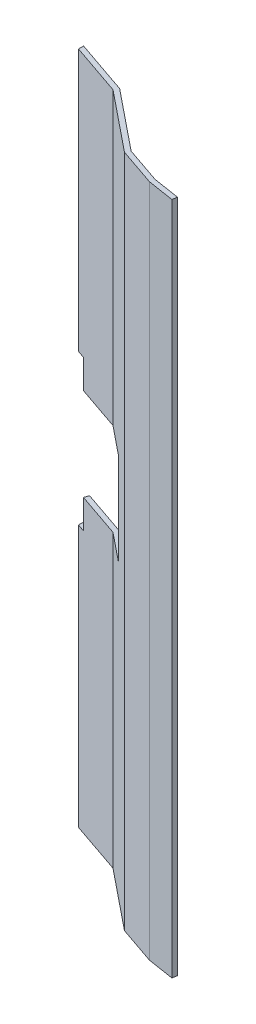
ISO-10303-21;
HEADER;
FILE_DESCRIPTION(('STEP AP214'),'2;1');
FILE_NAME('part.step','',(''),(''),'','','');
FILE_SCHEMA(('AUTOMOTIVE_DESIGN { 1 0 10303 214 1 1 1 1 }'));
ENDSEC;
DATA;
#1=APPLICATION_CONTEXT('core data for automotive mechanical design processes');
#2=APPLICATION_PROTOCOL_DEFINITION('international standard','automotive_design',2000,#1);
#3=PRODUCT_CONTEXT('',#1,'mechanical');
#4=PRODUCT('Part','Part','',(#3));
#5=PRODUCT_RELATED_PRODUCT_CATEGORY('part','',(#4));
#6=PRODUCT_DEFINITION_FORMATION('','',#4);
#7=PRODUCT_DEFINITION_CONTEXT('part definition',#1,'design');
#8=PRODUCT_DEFINITION('design','',#6,#7);
#9=PRODUCT_DEFINITION_SHAPE('','',#8);
#10=(LENGTH_UNIT() NAMED_UNIT(*) SI_UNIT(.MILLI.,.METRE.));
#11=(NAMED_UNIT(*) PLANE_ANGLE_UNIT() SI_UNIT($,.RADIAN.));
#12=(NAMED_UNIT(*) SI_UNIT($,.STERADIAN.) SOLID_ANGLE_UNIT());
#13=UNCERTAINTY_MEASURE_WITH_UNIT(LENGTH_MEASURE(1.E-05),#10,'distance_accuracy_value','');
#14=(GEOMETRIC_REPRESENTATION_CONTEXT(3) GLOBAL_UNCERTAINTY_ASSIGNED_CONTEXT((#13)) GLOBAL_UNIT_ASSIGNED_CONTEXT((#10,
#11,#12)) REPRESENTATION_CONTEXT('',''));
#15=CARTESIAN_POINT('',(0.,0.,0.));
#16=DIRECTION('',(0.,0.,1.));
#17=DIRECTION('',(1.,0.,0.));
#18=AXIS2_PLACEMENT_3D('',#15,#16,#17);
#19=CARTESIAN_POINT('',(-37.0625663664755,222.25,-23.5831818109705));
#20=DIRECTION('',(1.,0.,0.));
#21=DIRECTION('',(0.,0.,-1.));
#22=AXIS2_PLACEMENT_3D('',#19,#20,#21);
#23=PLANE('',#22);
#24=DIRECTION('',(0.,0.,1.));
#25=VECTOR('',#24,1.);
#26=CARTESIAN_POINT('',(-37.0625663664755,86.36,-23.5831818109705));
#27=LINE('',#26,#25);
#28=CARTESIAN_POINT('',(-37.0625663664755,86.36,-23.5831818109705));
#29=VERTEX_POINT('',#28);
#30=CARTESIAN_POINT('',(-37.0625663664755,86.36,-21.904788085952));
#31=VERTEX_POINT('',#30);
#32=EDGE_CURVE('E230',#29,#31,#27,.T.);
#33=ORIENTED_EDGE('',*,*,#32,.F.);
#34=DIRECTION('',(0.,-1.,0.));
#35=VECTOR('',#34,1.);
#36=CARTESIAN_POINT('',(-37.0625663664755,222.25,-23.5831818109705));
#37=LINE('',#36,#35);
#38=CARTESIAN_POINT('',(-37.0625663664755,0.,-23.5831818109705));
#39=VERTEX_POINT('',#38);
#40=EDGE_CURVE('E100',#29,#39,#37,.T.);
#41=ORIENTED_EDGE('',*,*,#40,.T.);
#42=DIRECTION('',(0.,0.,1.));
#43=VECTOR('',#42,1.);
#44=CARTESIAN_POINT('',(-37.0625663664755,0.,-23.5831818109705));
#45=LINE('',#44,#43);
#46=CARTESIAN_POINT('',(-37.0625663664755,0.,-21.904788085952));
#47=VERTEX_POINT('',#46);
#48=EDGE_CURVE('E161',#39,#47,#45,.T.);
#49=ORIENTED_EDGE('',*,*,#48,.T.);
#50=DIRECTION('',(0.,-1.,0.));
#51=VECTOR('',#50,1.);
#52=CARTESIAN_POINT('',(-37.0625663664755,222.25,-21.904788085952));
#53=LINE('',#52,#51);
#54=EDGE_CURVE('E205',#31,#47,#53,.T.);
#55=ORIENTED_EDGE('',*,*,#54,.F.);
#56=EDGE_LOOP('',(#33,#41,#49,#55));
#57=FACE_BOUND('',#56,.T.);
#58=ADVANCED_FACE('F36',(#57),#23,.F.);
#59=CARTESIAN_POINT('',(-37.0625663664755,222.25,-21.904788085952));
#60=DIRECTION('',(0.32461914387771,0.,-0.945844813607445));
#61=DIRECTION('',(-0.945844813607445,0.,-0.32461914387771));
#62=AXIS2_PLACEMENT_3D('',#59,#60,#61);
#63=PLANE('',#62);
#64=DIRECTION('',(0.945844813607445,0.,0.32461914387771));
#65=VECTOR('',#64,1.);
#66=CARTESIAN_POINT('',(-37.0625663664755,86.36,-21.904788085952));
#67=LINE('',#66,#65);
#68=CARTESIAN_POINT('',(-34.5748419741777,86.36,-21.0509873875569));
#69=VERTEX_POINT('',#68);
#70=EDGE_CURVE('E238',#31,#69,#67,.T.);
#71=ORIENTED_EDGE('',*,*,#70,.F.);
#72=ORIENTED_EDGE('',*,*,#54,.T.);
#73=DIRECTION('',(0.945844813607445,0.,0.32461914387771));
#74=VECTOR('',#73,1.);
#75=CARTESIAN_POINT('',(-37.0625663664755,0.,-21.904788085952));
#76=LINE('',#75,#74);
#77=CARTESIAN_POINT('',(-19.7555384832619,0.,-15.964920896652));
#78=VERTEX_POINT('',#77);
#79=EDGE_CURVE('E163',#47,#78,#76,.T.);
#80=ORIENTED_EDGE('',*,*,#79,.T.);
#81=DIRECTION('',(0.,-1.,0.));
#82=VECTOR('',#81,1.);
#83=CARTESIAN_POINT('',(-19.7555384832619,222.25,-15.964920896652));
#84=LINE('',#83,#82);
#85=CARTESIAN_POINT('',(-19.7555384832619,95.885,-15.964920896652));
#86=VERTEX_POINT('',#85);
#87=EDGE_CURVE('E201',#86,#78,#84,.T.);
#88=ORIENTED_EDGE('',*,*,#87,.F.);
#89=DIRECTION('',(0.945844813607445,0.,0.32461914387771));
#90=VECTOR('',#89,1.);
#91=CARTESIAN_POINT('',(-37.0625663664755,95.885,-21.904788085952));
#92=LINE('',#91,#90);
#93=CARTESIAN_POINT('',(-34.5748419741777,95.885,-21.0509873875569));
#94=VERTEX_POINT('',#93);
#95=EDGE_CURVE('E483',#94,#86,#92,.T.);
#96=ORIENTED_EDGE('',*,*,#95,.F.);
#97=DIRECTION('',(0.,-1.,0.));
#98=VECTOR('',#97,1.);
#99=CARTESIAN_POINT('',(-34.5748419741777,222.25,-21.0509873875569));
#100=LINE('',#99,#98);
#101=EDGE_CURVE('E239',#94,#69,#100,.T.);
#102=ORIENTED_EDGE('',*,*,#101,.T.);
#103=EDGE_LOOP('',(#71,#72,#80,#88,#96,#102));
#104=FACE_BOUND('',#103,.T.);
#105=ADVANCED_FACE('F253',(#104),#63,.F.);
#106=CARTESIAN_POINT('',(-19.7555384832619,222.25,-15.964920896652));
#107=DIRECTION('',(0.628540192781588,0.,-0.777777105640224));
#108=DIRECTION('',(-0.777777105640224,0.,-0.628540192781588));
#109=AXIS2_PLACEMENT_3D('',#106,#107,#108);
#110=PLANE('',#109);
#111=DIRECTION('',(0.777777105640224,0.,0.628540192781588));
#112=VECTOR('',#111,1.);
#113=CARTESIAN_POINT('',(-19.7555384832619,95.885,-15.964920896652));
#114=LINE('',#113,#112);
#115=CARTESIAN_POINT('',(-10.1235048545214,95.885,-8.18104524643741));
#116=VERTEX_POINT('',#115);
#117=EDGE_CURVE('E479',#86,#116,#114,.T.);
#118=ORIENTED_EDGE('',*,*,#117,.F.);
#119=ORIENTED_EDGE('',*,*,#87,.T.);
#120=DIRECTION('',(0.777777105640224,0.,0.628540192781588));
#121=VECTOR('',#120,1.);
#122=CARTESIAN_POINT('',(-19.7555384832619,0.,-15.964920896652));
#123=LINE('',#122,#121);
#124=CARTESIAN_POINT('',(-1.85654047094307E-13,0.,3.86479261003734E-13));
#125=VERTEX_POINT('',#124);
#126=EDGE_CURVE('E167',#78,#125,#123,.T.);
#127=ORIENTED_EDGE('',*,*,#126,.T.);
#128=DIRECTION('',(0.,-1.,0.));
#129=VECTOR('',#128,1.);
#130=CARTESIAN_POINT('',(-1.85654047094307E-13,222.25,3.86479261003734E-13));
#131=LINE('',#130,#129);
#132=CARTESIAN_POINT('',(-1.85654047094307E-13,222.25,3.86479261003734E-13));
#133=VERTEX_POINT('',#132);
#134=EDGE_CURVE('E198',#133,#125,#131,.T.);
#135=ORIENTED_EDGE('',*,*,#134,.F.);
#136=DIRECTION('',(0.777777105640224,0.,0.628540192781588));
#137=VECTOR('',#136,1.);
#138=CARTESIAN_POINT('',(-19.7555384832619,222.25,-15.964920896652));
#139=LINE('',#138,#137);
#140=CARTESIAN_POINT('',(-19.7555384832619,222.25,-15.964920896652));
#141=VERTEX_POINT('',#140);
#142=EDGE_CURVE('E277',#141,#133,#139,.T.);
#143=ORIENTED_EDGE('',*,*,#142,.F.);
#144=CARTESIAN_POINT('',(-19.7555384832619,126.365,-15.964920896652));
#145=VERTEX_POINT('',#144);
#146=EDGE_CURVE('E202',#141,#145,#84,.T.);
#147=ORIENTED_EDGE('',*,*,#146,.T.);
#148=DIRECTION('',(0.777777105640224,0.,0.628540192781588));
#149=VECTOR('',#148,1.);
#150=CARTESIAN_POINT('',(-19.7555384832619,126.365,-15.964920896652));
#151=LINE('',#150,#149);
#152=CARTESIAN_POINT('',(-10.1235048545214,126.365,-8.18104524643741));
#153=VERTEX_POINT('',#152);
#154=EDGE_CURVE('E491',#145,#153,#151,.T.);
#155=ORIENTED_EDGE('',*,*,#154,.T.);
#156=DIRECTION('',(0.,-1.,0.));
#157=VECTOR('',#156,1.);
#158=CARTESIAN_POINT('',(-10.1235048545214,222.25,-8.18104524643739));
#159=LINE('',#158,#157);
#160=EDGE_CURVE('E164',#153,#116,#159,.T.);
#161=ORIENTED_EDGE('',*,*,#160,.T.);
#162=EDGE_LOOP('',(#118,#119,#127,#135,#143,#147,#155,#161));
#163=FACE_BOUND('',#162,.T.);
#164=ADVANCED_FACE('F338',(#163),#110,.F.);
#165=CARTESIAN_POINT('',(0.780092902725611,222.25,-1.41066154888906));
#166=DIRECTION('',(-0.628540192781588,0.,0.777777105640224));
#167=DIRECTION('',(0.777777105640224,0.,0.628540192781588));
#168=AXIS2_PLACEMENT_3D('',#165,#166,#167);
#169=PLANE('',#168);
#170=DIRECTION('',(-0.777777105640224,0.,-0.628540192781588));
#171=VECTOR('',#170,1.);
#172=CARTESIAN_POINT('',(0.780092902725611,95.885,-1.41066154888906));
#173=LINE('',#172,#171);
#174=CARTESIAN_POINT('',(-9.5750990465936,95.885,-9.77893865156602));
#175=VERTEX_POINT('',#174);
#176=CARTESIAN_POINT('',(-18.9754455805351,95.885,-17.3755824455406));
#177=VERTEX_POINT('',#176);
#178=EDGE_CURVE('E297',#175,#177,#173,.T.);
#179=ORIENTED_EDGE('',*,*,#178,.F.);
#180=DIRECTION('',(0.,1.,0.));
#181=VECTOR('',#180,1.);
#182=CARTESIAN_POINT('',(-9.57509904659358,222.25,-9.77893865156601));
#183=LINE('',#182,#181);
#184=CARTESIAN_POINT('',(-9.5750990465936,126.365,-9.77893865156603));
#185=VERTEX_POINT('',#184);
#186=EDGE_CURVE('E11',#175,#185,#183,.T.);
#187=ORIENTED_EDGE('',*,*,#186,.T.);
#188=DIRECTION('',(-0.777777105640224,0.,-0.628540192781588));
#189=VECTOR('',#188,1.);
#190=CARTESIAN_POINT('',(0.780092902725611,126.365,-1.41066154888906));
#191=LINE('',#190,#189);
#192=CARTESIAN_POINT('',(-18.9754455805351,126.365,-17.3755824455406));
#193=VERTEX_POINT('',#192);
#194=EDGE_CURVE('E493',#185,#193,#191,.T.);
#195=ORIENTED_EDGE('',*,*,#194,.T.);
#196=DIRECTION('',(0.,-1.,0.));
#197=VECTOR('',#196,1.);
#198=CARTESIAN_POINT('',(-18.9754455805351,222.25,-17.3755824455406));
#199=LINE('',#198,#197);
#200=CARTESIAN_POINT('',(-18.9754455805351,222.25,-17.3755824455406));
#201=VERTEX_POINT('',#200);
#202=EDGE_CURVE('E151',#201,#193,#199,.T.);
#203=ORIENTED_EDGE('',*,*,#202,.F.);
#204=DIRECTION('',(-0.777777105640224,0.,-0.628540192781588));
#205=VECTOR('',#204,1.);
#206=CARTESIAN_POINT('',(0.780092902725611,222.25,-1.41066154888906));
#207=LINE('',#206,#205);
#208=CARTESIAN_POINT('',(0.780092902725611,222.25,-1.41066154888906));
#209=VERTEX_POINT('',#208);
#210=EDGE_CURVE('E134',#209,#201,#207,.T.);
#211=ORIENTED_EDGE('',*,*,#210,.F.);
#212=DIRECTION('',(0.,-1.,0.));
#213=VECTOR('',#212,1.);
#214=CARTESIAN_POINT('',(0.780092902725611,222.25,-1.41066154888906));
#215=LINE('',#214,#213);
#216=CARTESIAN_POINT('',(0.780092902725611,0.,-1.41066154888906));
#217=VERTEX_POINT('',#216);
#218=EDGE_CURVE('E143',#209,#217,#215,.T.);
#219=ORIENTED_EDGE('',*,*,#218,.T.);
#220=DIRECTION('',(-0.777777105640224,0.,-0.628540192781588));
#221=VECTOR('',#220,1.);
#222=CARTESIAN_POINT('',(0.780092902725611,0.,-1.41066154888906));
#223=LINE('',#222,#221);
#224=CARTESIAN_POINT('',(-18.9754455805351,0.,-17.3755824455406));
#225=VERTEX_POINT('',#224);
#226=EDGE_CURVE('E178',#217,#225,#223,.T.);
#227=ORIENTED_EDGE('',*,*,#226,.T.);
#228=EDGE_CURVE('E186',#177,#225,#199,.T.);
#229=ORIENTED_EDGE('',*,*,#228,.F.);
#230=EDGE_LOOP('',(#179,#187,#195,#203,#211,#219,#227,#229));
#231=FACE_BOUND('',#230,.T.);
#232=ADVANCED_FACE('F154',(#231),#169,.F.);
#233=CARTESIAN_POINT('',(-18.9754455805351,222.25,-17.3755824455406));
#234=DIRECTION('',(-0.32461914387771,0.,0.945844813607445));
#235=DIRECTION('',(0.945844813607445,0.,0.32461914387771));
#236=AXIS2_PLACEMENT_3D('',#233,#234,#235);
#237=PLANE('',#236);
#238=DIRECTION('',(-0.945844813607445,0.,-0.32461914387771));
#239=VECTOR('',#238,1.);
#240=CARTESIAN_POINT('',(-18.9754455805351,86.36,-17.3755824455406));
#241=LINE('',#240,#239);
#242=CARTESIAN_POINT('',(-34.0595090832718,86.36,-22.5525160291587));
#243=VERTEX_POINT('',#242);
#244=EDGE_CURVE('E44',#243,#29,#241,.T.);
#245=ORIENTED_EDGE('',*,*,#244,.F.);
#246=DIRECTION('',(0.,1.,0.));
#247=VECTOR('',#246,1.);
#248=CARTESIAN_POINT('',(-34.0595090832718,222.25,-22.5525160291587));
#249=LINE('',#248,#247);
#250=CARTESIAN_POINT('',(-34.0595090832718,95.885,-22.5525160291588));
#251=VERTEX_POINT('',#250);
#252=EDGE_CURVE('E219',#243,#251,#249,.T.);
#253=ORIENTED_EDGE('',*,*,#252,.T.);
#254=DIRECTION('',(-0.945844813607445,0.,-0.32461914387771));
#255=VECTOR('',#254,1.);
#256=CARTESIAN_POINT('',(-18.9754455805351,95.885,-17.3755824455406));
#257=LINE('',#256,#255);
#258=EDGE_CURVE('E216',#177,#251,#257,.T.);
#259=ORIENTED_EDGE('',*,*,#258,.F.);
#260=ORIENTED_EDGE('',*,*,#228,.T.);
#261=DIRECTION('',(-0.945844813607445,0.,-0.32461914387771));
#262=VECTOR('',#261,1.);
#263=CARTESIAN_POINT('',(-18.9754455805351,0.,-17.3755824455406));
#264=LINE('',#263,#262);
#265=EDGE_CURVE('E180',#225,#39,#264,.T.);
#266=ORIENTED_EDGE('',*,*,#265,.T.);
#267=ORIENTED_EDGE('',*,*,#40,.F.);
#268=EDGE_LOOP('',(#245,#253,#259,#260,#266,#267));
#269=FACE_BOUND('',#268,.T.);
#270=ADVANCED_FACE('F241',(#269),#237,.F.);
#271=CARTESIAN_POINT('',(-37.0625663664755,222.25,-23.5831818109705));
#272=VERTEX_POINT('',#271);
#273=CARTESIAN_POINT('',(-37.0625663664755,135.89,-23.5831818109705));
#274=VERTEX_POINT('',#273);
#275=EDGE_CURVE('E183',#272,#274,#37,.T.);
#276=ORIENTED_EDGE('',*,*,#275,.T.);
#277=DIRECTION('',(0.,0.,1.));
#278=VECTOR('',#277,1.);
#279=CARTESIAN_POINT('',(-37.0625663664755,135.89,-23.5831818109705));
#280=LINE('',#279,#278);
#281=CARTESIAN_POINT('',(-37.0625663664755,135.89,-21.904788085952));
#282=VERTEX_POINT('',#281);
#283=EDGE_CURVE('E261',#274,#282,#280,.T.);
#284=ORIENTED_EDGE('',*,*,#283,.T.);
#285=CARTESIAN_POINT('',(-37.0625663664755,222.25,-21.904788085952));
#286=VERTEX_POINT('',#285);
#287=EDGE_CURVE('E206',#286,#282,#53,.T.);
#288=ORIENTED_EDGE('',*,*,#287,.F.);
#289=DIRECTION('',(0.,0.,1.));
#290=VECTOR('',#289,1.);
#291=CARTESIAN_POINT('',(-37.0625663664755,222.25,-23.5831818109705));
#292=LINE('',#291,#290);
#293=EDGE_CURVE('E182',#272,#286,#292,.T.);
#294=ORIENTED_EDGE('',*,*,#293,.F.);
#295=EDGE_LOOP('',(#276,#284,#288,#294));
#296=FACE_BOUND('',#295,.T.);
#297=ADVANCED_FACE('F38',(#296),#23,.F.);
#298=ORIENTED_EDGE('',*,*,#287,.T.);
#299=DIRECTION('',(0.945844813607445,0.,0.32461914387771));
#300=VECTOR('',#299,1.);
#301=CARTESIAN_POINT('',(-37.0625663664755,135.89,-21.904788085952));
#302=LINE('',#301,#300);
#303=CARTESIAN_POINT('',(-34.5748419741777,135.89,-21.0509873875569));
#304=VERTEX_POINT('',#303);
#305=EDGE_CURVE('E264',#282,#304,#302,.T.);
#306=ORIENTED_EDGE('',*,*,#305,.T.);
#307=DIRECTION('',(0.,1.,0.));
#308=VECTOR('',#307,1.);
#309=CARTESIAN_POINT('',(-34.5748419741777,222.25,-21.0509873875569));
#310=LINE('',#309,#308);
#311=CARTESIAN_POINT('',(-34.5748419741777,126.365,-21.0509873875569));
#312=VERTEX_POINT('',#311);
#313=EDGE_CURVE('E270',#312,#304,#310,.T.);
#314=ORIENTED_EDGE('',*,*,#313,.F.);
#315=DIRECTION('',(0.945844813607445,0.,0.32461914387771));
#316=VECTOR('',#315,1.);
#317=CARTESIAN_POINT('',(-37.0625663664755,126.365,-21.904788085952));
#318=LINE('',#317,#316);
#319=EDGE_CURVE('E486',#312,#145,#318,.T.);
#320=ORIENTED_EDGE('',*,*,#319,.T.);
#321=ORIENTED_EDGE('',*,*,#146,.F.);
#322=DIRECTION('',(0.945844813607445,0.,0.32461914387771));
#323=VECTOR('',#322,1.);
#324=CARTESIAN_POINT('',(-37.0625663664755,222.25,-21.904788085952));
#325=LINE('',#324,#323);
#326=EDGE_CURVE('E109',#286,#141,#325,.T.);
#327=ORIENTED_EDGE('',*,*,#326,.F.);
#328=EDGE_LOOP('',(#298,#306,#314,#320,#321,#327));
#329=FACE_BOUND('',#328,.T.);
#330=ADVANCED_FACE('F326',(#329),#63,.F.);
#331=CARTESIAN_POINT('',(-1.85654047094307E-13,222.25,3.86479261003734E-13));
#332=DIRECTION('',(0.32461914387771,0.,-0.945844813607445));
#333=DIRECTION('',(-0.945844813607445,0.,-0.32461914387771));
#334=AXIS2_PLACEMENT_3D('',#331,#332,#333);
#335=PLANE('',#334);
#336=DIRECTION('',(0.945844813607445,0.,0.32461914387771));
#337=VECTOR('',#336,1.);
#338=CARTESIAN_POINT('',(-1.85654047094307E-13,0.,3.86479261003734E-13));
#339=LINE('',#338,#337);
#340=CARTESIAN_POINT('',(12.5417491564539,0.,4.30439731267288));
#341=VERTEX_POINT('',#340);
#342=EDGE_CURVE('E169',#125,#341,#339,.T.);
#343=ORIENTED_EDGE('',*,*,#342,.T.);
#344=DIRECTION('',(0.,-1.,0.));
#345=VECTOR('',#344,1.);
#346=CARTESIAN_POINT('',(12.5417491564539,222.25,4.30439731267288));
#347=LINE('',#346,#345);
#348=CARTESIAN_POINT('',(12.5417491564539,222.25,4.30439731267288));
#349=VERTEX_POINT('',#348);
#350=EDGE_CURVE('E195',#349,#341,#347,.T.);
#351=ORIENTED_EDGE('',*,*,#350,.F.);
#352=DIRECTION('',(0.945844813607445,0.,0.32461914387771));
#353=VECTOR('',#352,1.);
#354=CARTESIAN_POINT('',(-1.85654047094307E-13,222.25,3.86479261003734E-13));
#355=LINE('',#354,#353);
#356=EDGE_CURVE('E279',#133,#349,#355,.T.);
#357=ORIENTED_EDGE('',*,*,#356,.F.);
#358=ORIENTED_EDGE('',*,*,#134,.T.);
#359=EDGE_LOOP('',(#343,#351,#357,#358));
#360=FACE_BOUND('',#359,.T.);
#361=ADVANCED_FACE('F328',(#360),#335,.F.);
#362=CARTESIAN_POINT('',(12.5417491564539,222.25,4.30439731267288));
#363=DIRECTION('',(0.155443221428295,0.,-0.987844828357164));
#364=DIRECTION('',(-0.987844828357164,0.,-0.155443221428295));
#365=AXIS2_PLACEMENT_3D('',#362,#363,#364);
#366=PLANE('',#365);
#367=DIRECTION('',(0.987844828357164,0.,0.155443221428295));
#368=VECTOR('',#367,1.);
#369=CARTESIAN_POINT('',(12.5417491564539,0.,4.30439731267288));
#370=LINE('',#369,#368);
#371=CARTESIAN_POINT('',(21.3236896805516,0.,5.68628755117083));
#372=VERTEX_POINT('',#371);
#373=EDGE_CURVE('E171',#341,#372,#370,.T.);
#374=ORIENTED_EDGE('',*,*,#373,.T.);
#375=DIRECTION('',(0.,-1.,0.));
#376=VECTOR('',#375,1.);
#377=CARTESIAN_POINT('',(21.3236896805516,222.25,5.68628755117083));
#378=LINE('',#377,#376);
#379=CARTESIAN_POINT('',(21.3236896805516,222.25,5.68628755117083));
#380=VERTEX_POINT('',#379);
#381=EDGE_CURVE('E192',#380,#372,#378,.T.);
#382=ORIENTED_EDGE('',*,*,#381,.F.);
#383=DIRECTION('',(0.987844828357164,0.,0.155443221428295));
#384=VECTOR('',#383,1.);
#385=CARTESIAN_POINT('',(12.5417491564539,222.25,4.30439731267288));
#386=LINE('',#385,#384);
#387=EDGE_CURVE('E281',#349,#380,#386,.T.);
#388=ORIENTED_EDGE('',*,*,#387,.F.);
#389=ORIENTED_EDGE('',*,*,#350,.T.);
#390=EDGE_LOOP('',(#374,#382,#388,#389));
#391=FACE_BOUND('',#390,.T.);
#392=ADVANCED_FACE('F333',(#391),#366,.F.);
#393=CARTESIAN_POINT('',(21.3236896805516,222.25,5.68628755117083));
#394=DIRECTION('',(-0.987844828357163,0.,-0.155443221428296));
#395=DIRECTION('',(-0.155443221428296,0.,0.987844828357163));
#396=AXIS2_PLACEMENT_3D('',#393,#394,#395);
#397=PLANE('',#396);
#398=DIRECTION('',(0.155443221428296,0.,-0.987844828357163));
#399=VECTOR('',#398,1.);
#400=CARTESIAN_POINT('',(21.3236896805516,0.,5.68628755117083));
#401=LINE('',#400,#399);
#402=CARTESIAN_POINT('',(21.5742625596366,0.,4.09389181685581));
#403=VERTEX_POINT('',#402);
#404=EDGE_CURVE('E173',#372,#403,#401,.T.);
#405=ORIENTED_EDGE('',*,*,#404,.T.);
#406=DIRECTION('',(0.,-1.,0.));
#407=VECTOR('',#406,1.);
#408=CARTESIAN_POINT('',(21.5742625596366,222.25,4.09389181685581));
#409=LINE('',#408,#407);
#410=CARTESIAN_POINT('',(21.5742625596366,222.25,4.09389181685581));
#411=VERTEX_POINT('',#410);
#412=EDGE_CURVE('E189',#411,#403,#409,.T.);
#413=ORIENTED_EDGE('',*,*,#412,.F.);
#414=DIRECTION('',(0.155443221428296,0.,-0.987844828357163));
#415=VECTOR('',#414,1.);
#416=CARTESIAN_POINT('',(21.3236896805516,222.25,5.68628755117083));
#417=LINE('',#416,#415);
#418=EDGE_CURVE('E283',#380,#411,#417,.T.);
#419=ORIENTED_EDGE('',*,*,#418,.F.);
#420=ORIENTED_EDGE('',*,*,#381,.T.);
#421=EDGE_LOOP('',(#405,#413,#419,#420));
#422=FACE_BOUND('',#421,.T.);
#423=ADVANCED_FACE('F289',(#422),#397,.F.);
#424=CARTESIAN_POINT('',(21.5742625596366,222.25,4.09389181685581));
#425=DIRECTION('',(-0.155443221428295,0.,0.987844828357164));
#426=DIRECTION('',(0.987844828357164,0.,0.155443221428295));
#427=AXIS2_PLACEMENT_3D('',#424,#425,#426);
#428=PLANE('',#427);
#429=DIRECTION('',(-0.987844828357164,0.,-0.155443221428295));
#430=VECTOR('',#429,1.);
#431=CARTESIAN_POINT('',(21.5742625596366,0.,4.09389181685581));
#432=LINE('',#431,#430);
#433=CARTESIAN_POINT('',(12.7923220355414,0.,2.71200157835827));
#434=VERTEX_POINT('',#433);
#435=EDGE_CURVE('E175',#403,#434,#432,.T.);
#436=ORIENTED_EDGE('',*,*,#435,.T.);
#437=DIRECTION('',(0.,-1.,0.));
#438=VECTOR('',#437,1.);
#439=CARTESIAN_POINT('',(12.7923220355414,222.25,2.71200157835827));
#440=LINE('',#439,#438);
#441=CARTESIAN_POINT('',(12.7923220355414,222.25,2.71200157835827));
#442=VERTEX_POINT('',#441);
#443=EDGE_CURVE('E150',#442,#434,#440,.T.);
#444=ORIENTED_EDGE('',*,*,#443,.F.);
#445=DIRECTION('',(-0.987844828357164,0.,-0.155443221428295));
#446=VECTOR('',#445,1.);
#447=CARTESIAN_POINT('',(21.5742625596366,222.25,4.09389181685581));
#448=LINE('',#447,#446);
#449=EDGE_CURVE('E137',#411,#442,#448,.T.);
#450=ORIENTED_EDGE('',*,*,#449,.F.);
#451=ORIENTED_EDGE('',*,*,#412,.T.);
#452=EDGE_LOOP('',(#436,#444,#450,#451));
#453=FACE_BOUND('',#452,.T.);
#454=ADVANCED_FACE('F293',(#453),#428,.F.);
#455=CARTESIAN_POINT('',(12.7923220355414,222.25,2.71200157835827));
#456=DIRECTION('',(-0.32461914387771,0.,0.945844813607445));
#457=DIRECTION('',(0.945844813607445,0.,0.32461914387771));
#458=AXIS2_PLACEMENT_3D('',#455,#456,#457);
#459=PLANE('',#458);
#460=DIRECTION('',(-0.945844813607445,0.,-0.32461914387771));
#461=VECTOR('',#460,1.);
#462=CARTESIAN_POINT('',(12.7923220355414,0.,2.71200157835827));
#463=LINE('',#462,#461);
#464=EDGE_CURVE('E146',#434,#217,#463,.T.);
#465=ORIENTED_EDGE('',*,*,#464,.T.);
#466=ORIENTED_EDGE('',*,*,#218,.F.);
#467=DIRECTION('',(-0.945844813607445,0.,-0.32461914387771));
#468=VECTOR('',#467,1.);
#469=CARTESIAN_POINT('',(12.7923220355414,222.25,2.71200157835827));
#470=LINE('',#469,#468);
#471=EDGE_CURVE('E130',#442,#209,#470,.T.);
#472=ORIENTED_EDGE('',*,*,#471,.F.);
#473=ORIENTED_EDGE('',*,*,#443,.T.);
#474=EDGE_LOOP('',(#465,#466,#472,#473));
#475=FACE_BOUND('',#474,.T.);
#476=ADVANCED_FACE('F144',(#475),#459,.F.);
#477=DIRECTION('',(0.,-1.,0.));
#478=VECTOR('',#477,1.);
#479=CARTESIAN_POINT('',(-34.0595090832718,222.25,-22.5525160291587));
#480=LINE('',#479,#478);
#481=CARTESIAN_POINT('',(-34.0595090832718,135.89,-22.5525160291587));
#482=VERTEX_POINT('',#481);
#483=CARTESIAN_POINT('',(-34.0595090832718,126.365,-22.5525160291587));
#484=VERTEX_POINT('',#483);
#485=EDGE_CURVE('E211',#482,#484,#480,.T.);
#486=ORIENTED_EDGE('',*,*,#485,.F.);
#487=DIRECTION('',(-0.945844813607445,0.,-0.32461914387771));
#488=VECTOR('',#487,1.);
#489=CARTESIAN_POINT('',(-18.9754455805351,135.89,-17.3755824455406));
#490=LINE('',#489,#488);
#491=EDGE_CURVE('E213',#482,#274,#490,.T.);
#492=ORIENTED_EDGE('',*,*,#491,.T.);
#493=ORIENTED_EDGE('',*,*,#275,.F.);
#494=DIRECTION('',(-0.945844813607445,0.,-0.32461914387771));
#495=VECTOR('',#494,1.);
#496=CARTESIAN_POINT('',(-18.9754455805351,222.25,-17.3755824455406));
#497=LINE('',#496,#495);
#498=EDGE_CURVE('E60',#201,#272,#497,.T.);
#499=ORIENTED_EDGE('',*,*,#498,.F.);
#500=ORIENTED_EDGE('',*,*,#202,.T.);
#501=DIRECTION('',(-0.945844813607445,0.,-0.32461914387771));
#502=VECTOR('',#501,1.);
#503=CARTESIAN_POINT('',(-18.9754455805351,126.365,-17.3755824455406));
#504=LINE('',#503,#502);
#505=EDGE_CURVE('E208',#193,#484,#504,.T.);
#506=ORIENTED_EDGE('',*,*,#505,.T.);
#507=EDGE_LOOP('',(#486,#492,#493,#499,#500,#506));
#508=FACE_BOUND('',#507,.T.);
#509=ADVANCED_FACE('F365',(#508),#237,.F.);
#510=CARTESIAN_POINT('',(0.,222.25,0.));
#511=DIRECTION('',(0.,1.,0.));
#512=DIRECTION('',(0.,0.,1.));
#513=AXIS2_PLACEMENT_3D('',#510,#511,#512);
#514=PLANE('',#513);
#515=ORIENTED_EDGE('',*,*,#293,.T.);
#516=ORIENTED_EDGE('',*,*,#326,.T.);
#517=ORIENTED_EDGE('',*,*,#142,.T.);
#518=ORIENTED_EDGE('',*,*,#356,.T.);
#519=ORIENTED_EDGE('',*,*,#387,.T.);
#520=ORIENTED_EDGE('',*,*,#418,.T.);
#521=ORIENTED_EDGE('',*,*,#449,.T.);
#522=ORIENTED_EDGE('',*,*,#471,.T.);
#523=ORIENTED_EDGE('',*,*,#210,.T.);
#524=ORIENTED_EDGE('',*,*,#498,.T.);
#525=EDGE_LOOP('',(#515,#516,#517,#518,#519,#520,#521,#522,#523,#524));
#526=FACE_BOUND('',#525,.T.);
#527=ADVANCED_FACE('F132',(#526),#514,.T.);
#528=CARTESIAN_POINT('',(0.,0.,0.));
#529=DIRECTION('',(0.,1.,0.));
#530=DIRECTION('',(0.,0.,1.));
#531=AXIS2_PLACEMENT_3D('',#528,#529,#530);
#532=PLANE('',#531);
#533=ORIENTED_EDGE('',*,*,#48,.F.);
#534=ORIENTED_EDGE('',*,*,#265,.F.);
#535=ORIENTED_EDGE('',*,*,#226,.F.);
#536=ORIENTED_EDGE('',*,*,#464,.F.);
#537=ORIENTED_EDGE('',*,*,#435,.F.);
#538=ORIENTED_EDGE('',*,*,#404,.F.);
#539=ORIENTED_EDGE('',*,*,#373,.F.);
#540=ORIENTED_EDGE('',*,*,#342,.F.);
#541=ORIENTED_EDGE('',*,*,#126,.F.);
#542=ORIENTED_EDGE('',*,*,#79,.F.);
#543=EDGE_LOOP('',(#533,#534,#535,#536,#537,#538,#539,#540,#541,#542));
#544=FACE_BOUND('',#543,.T.);
#545=ADVANCED_FACE('F248',(#544),#532,.F.);
#546=CARTESIAN_POINT('',(-17.2200948165055,0.,12.496332956402));
#547=DIRECTION('',(0.945844813607445,0.,0.32461914387771));
#548=DIRECTION('',(0.32461914387771,0.,-0.945844813607445));
#549=AXIS2_PLACEMENT_3D('',#546,#547,#548);
#550=PLANE('',#549);
#551=DIRECTION('',(0.32461914387771,0.,-0.945844813607445));
#552=VECTOR('',#551,1.);
#553=CARTESIAN_POINT('',(-17.2200948165055,126.365,12.496332956402));
#554=LINE('',#553,#552);
#555=EDGE_CURVE('E496',#153,#185,#554,.T.);
#556=ORIENTED_EDGE('',*,*,#555,.T.);
#557=ORIENTED_EDGE('',*,*,#186,.F.);
#558=DIRECTION('',(0.32461914387771,0.,-0.945844813607445));
#559=VECTOR('',#558,1.);
#560=CARTESIAN_POINT('',(-17.2200948165055,95.885,12.496332956402));
#561=LINE('',#560,#559);
#562=EDGE_CURVE('E499',#116,#175,#561,.T.);
#563=ORIENTED_EDGE('',*,*,#562,.F.);
#564=ORIENTED_EDGE('',*,*,#160,.F.);
#565=EDGE_LOOP('',(#556,#557,#563,#564));
#566=FACE_BOUND('',#565,.T.);
#567=ADVANCED_FACE('F392',(#566),#550,.F.);
#568=CARTESIAN_POINT('',(-43.0463874520568,0.,3.63260723282109));
#569=DIRECTION('',(-0.945844813607445,0.,-0.32461914387771));
#570=DIRECTION('',(-0.32461914387771,0.,0.945844813607445));
#571=AXIS2_PLACEMENT_3D('',#568,#569,#570);
#572=PLANE('',#571);
#573=ORIENTED_EDGE('',*,*,#313,.T.);
#574=DIRECTION('',(0.32461914387771,0.,-0.945844813607445));
#575=VECTOR('',#574,1.);
#576=CARTESIAN_POINT('',(-43.0463874520568,135.89,3.63260723282109));
#577=LINE('',#576,#575);
#578=EDGE_CURVE('E321',#304,#482,#577,.T.);
#579=ORIENTED_EDGE('',*,*,#578,.T.);
#580=ORIENTED_EDGE('',*,*,#485,.T.);
#581=DIRECTION('',(0.32461914387771,0.,-0.945844813607445));
#582=VECTOR('',#581,1.);
#583=CARTESIAN_POINT('',(-43.0463874520568,126.365,3.63260723282108));
#584=LINE('',#583,#582);
#585=EDGE_CURVE('E51',#312,#484,#584,.T.);
#586=ORIENTED_EDGE('',*,*,#585,.F.);
#587=EDGE_LOOP('',(#573,#579,#580,#586));
#588=FACE_BOUND('',#587,.T.);
#589=ADVANCED_FACE('F397',(#588),#572,.T.);
#590=CARTESIAN_POINT('',(-5.65147781055028,135.89,16.4667459610462));
#591=DIRECTION('',(0.,1.,0.));
#592=DIRECTION('',(0.,0.,1.));
#593=AXIS2_PLACEMENT_3D('',#590,#591,#592);
#594=PLANE('',#593);
#595=ORIENTED_EDGE('',*,*,#283,.F.);
#596=ORIENTED_EDGE('',*,*,#491,.F.);
#597=ORIENTED_EDGE('',*,*,#578,.F.);
#598=ORIENTED_EDGE('',*,*,#305,.F.);
#599=EDGE_LOOP('',(#595,#596,#597,#598));
#600=FACE_BOUND('',#599,.T.);
#601=ADVANCED_FACE('F320',(#600),#594,.F.);
#602=CARTESIAN_POINT('',(-5.65147781055028,86.36,16.4667459610462));
#603=DIRECTION('',(0.,1.,0.));
#604=DIRECTION('',(0.,0.,1.));
#605=AXIS2_PLACEMENT_3D('',#602,#603,#604);
#606=PLANE('',#605);
#607=ORIENTED_EDGE('',*,*,#70,.T.);
#608=DIRECTION('',(0.32461914387771,0.,-0.945844813607445));
#609=VECTOR('',#608,1.);
#610=CARTESIAN_POINT('',(-43.0463874520568,86.36,3.63260723282109));
#611=LINE('',#610,#609);
#612=EDGE_CURVE('E234',#69,#243,#611,.T.);
#613=ORIENTED_EDGE('',*,*,#612,.T.);
#614=ORIENTED_EDGE('',*,*,#244,.T.);
#615=ORIENTED_EDGE('',*,*,#32,.T.);
#616=EDGE_LOOP('',(#607,#613,#614,#615));
#617=FACE_BOUND('',#616,.T.);
#618=ADVANCED_FACE('F228',(#617),#606,.T.);
#619=CARTESIAN_POINT('',(-43.0463874520568,0.,3.63260723282108));
#620=DIRECTION('',(0.945844813607445,0.,0.32461914387771));
#621=DIRECTION('',(0.32461914387771,0.,-0.945844813607445));
#622=AXIS2_PLACEMENT_3D('',#619,#620,#621);
#623=PLANE('',#622);
#624=DIRECTION('',(0.32461914387771,0.,-0.945844813607445));
#625=VECTOR('',#624,1.);
#626=CARTESIAN_POINT('',(-43.0463874520568,95.885,3.63260723282108));
#627=LINE('',#626,#625);
#628=EDGE_CURVE('E501',#94,#251,#627,.T.);
#629=ORIENTED_EDGE('',*,*,#628,.T.);
#630=ORIENTED_EDGE('',*,*,#252,.F.);
#631=ORIENTED_EDGE('',*,*,#612,.F.);
#632=ORIENTED_EDGE('',*,*,#101,.F.);
#633=EDGE_LOOP('',(#629,#630,#631,#632));
#634=FACE_BOUND('',#633,.T.);
#635=ADVANCED_FACE('F425',(#634),#623,.F.);
#636=CARTESIAN_POINT('',(-5.65147781055028,95.885,16.4667459610462));
#637=DIRECTION('',(0.,1.,0.));
#638=DIRECTION('',(0.,0.,1.));
#639=AXIS2_PLACEMENT_3D('',#636,#637,#638);
#640=PLANE('',#639);
#641=ORIENTED_EDGE('',*,*,#95,.T.);
#642=ORIENTED_EDGE('',*,*,#117,.T.);
#643=ORIENTED_EDGE('',*,*,#562,.T.);
#644=ORIENTED_EDGE('',*,*,#178,.T.);
#645=ORIENTED_EDGE('',*,*,#258,.T.);
#646=ORIENTED_EDGE('',*,*,#628,.F.);
#647=EDGE_LOOP('',(#641,#642,#643,#644,#645,#646));
#648=FACE_BOUND('',#647,.T.);
#649=ADVANCED_FACE('F434',(#648),#640,.T.);
#650=CARTESIAN_POINT('',(-5.65147781055028,126.365,16.4667459610462));
#651=DIRECTION('',(0.,1.,0.));
#652=DIRECTION('',(0.,0.,1.));
#653=AXIS2_PLACEMENT_3D('',#650,#651,#652);
#654=PLANE('',#653);
#655=ORIENTED_EDGE('',*,*,#585,.T.);
#656=ORIENTED_EDGE('',*,*,#505,.F.);
#657=ORIENTED_EDGE('',*,*,#194,.F.);
#658=ORIENTED_EDGE('',*,*,#555,.F.);
#659=ORIENTED_EDGE('',*,*,#154,.F.);
#660=ORIENTED_EDGE('',*,*,#319,.F.);
#661=EDGE_LOOP('',(#655,#656,#657,#658,#659,#660));
#662=FACE_BOUND('',#661,.T.);
#663=ADVANCED_FACE('F445',(#662),#654,.F.);
#664=CLOSED_SHELL('',(#58,#105,#164,#232,#270,#297,#330,#361,#392,#423,#454,#476,#509,#527,#545,
#567,#589,#601,#618,#635,#649,#663));
#665=MANIFOLD_SOLID_BREP('B2',#664);
#666=ADVANCED_BREP_SHAPE_REPRESENTATION('',(#18,#665),#14);
#667=SHAPE_DEFINITION_REPRESENTATION(#9,#666);
ENDSEC;
END-ISO-10303-21;
